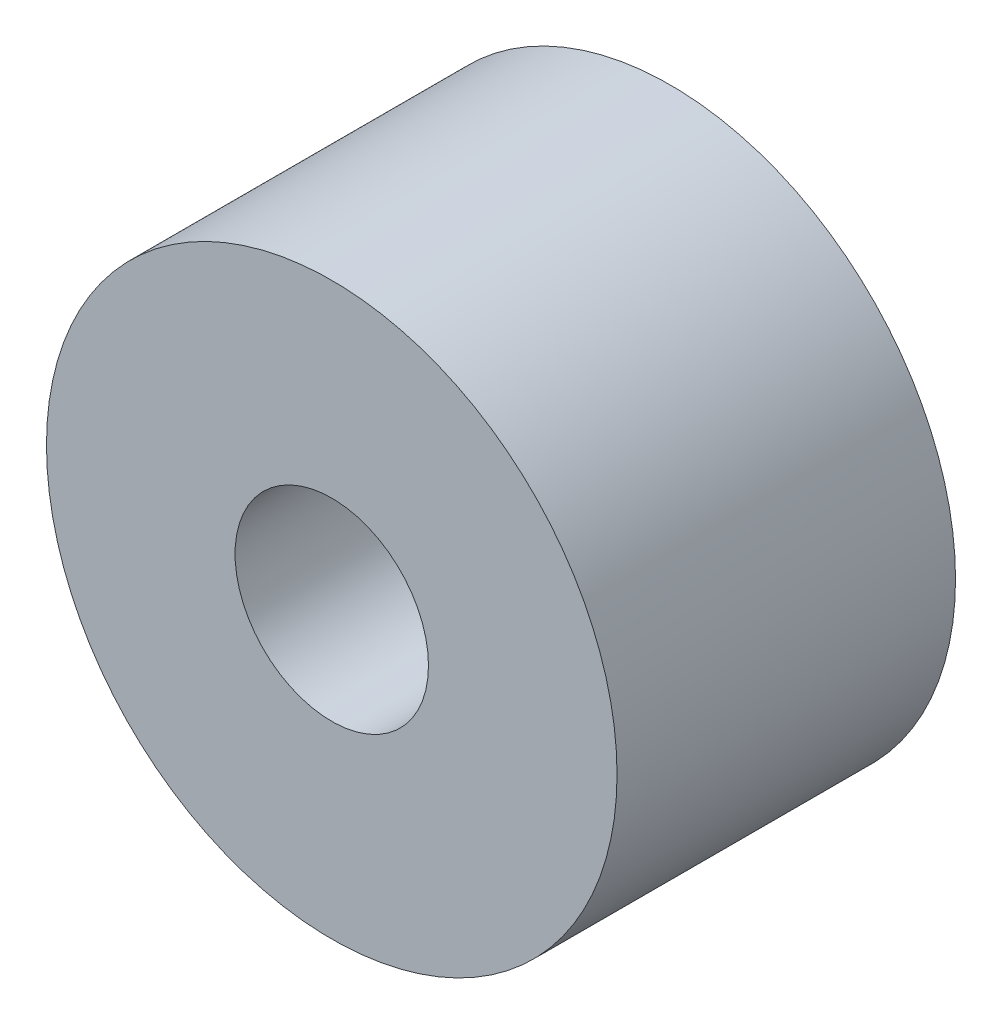
ISO-10303-21;
HEADER;
FILE_DESCRIPTION(('STEP AP214'),'2;1');
FILE_NAME('part.step','',(''),(''),'','','');
FILE_SCHEMA(('AUTOMOTIVE_DESIGN { 1 0 10303 214 1 1 1 1 }'));
ENDSEC;
DATA;
#1=APPLICATION_CONTEXT('core data for automotive mechanical design processes');
#2=APPLICATION_PROTOCOL_DEFINITION('international standard','automotive_design',2000,#1);
#3=PRODUCT_CONTEXT('',#1,'mechanical');
#4=PRODUCT('Part','Part','',(#3));
#5=PRODUCT_RELATED_PRODUCT_CATEGORY('part','',(#4));
#6=PRODUCT_DEFINITION_FORMATION('','',#4);
#7=PRODUCT_DEFINITION_CONTEXT('part definition',#1,'design');
#8=PRODUCT_DEFINITION('design','',#6,#7);
#9=PRODUCT_DEFINITION_SHAPE('','',#8);
#10=(LENGTH_UNIT() NAMED_UNIT(*) SI_UNIT(.MILLI.,.METRE.));
#11=(NAMED_UNIT(*) PLANE_ANGLE_UNIT() SI_UNIT($,.RADIAN.));
#12=(NAMED_UNIT(*) SI_UNIT($,.STERADIAN.) SOLID_ANGLE_UNIT());
#13=UNCERTAINTY_MEASURE_WITH_UNIT(LENGTH_MEASURE(1.E-05),#10,'distance_accuracy_value','');
#14=(GEOMETRIC_REPRESENTATION_CONTEXT(3) GLOBAL_UNCERTAINTY_ASSIGNED_CONTEXT((#13)) GLOBAL_UNIT_ASSIGNED_CONTEXT((#10,
#11,#12)) REPRESENTATION_CONTEXT('',''));
#15=CARTESIAN_POINT('',(0.,0.,0.));
#16=DIRECTION('',(0.,0.,1.));
#17=DIRECTION('',(1.,0.,0.));
#18=AXIS2_PLACEMENT_3D('',#15,#16,#17);
#19=CARTESIAN_POINT('',(0.,0.,7.));
#20=DIRECTION('',(0.,0.,1.));
#21=DIRECTION('',(1.,0.,0.));
#22=AXIS2_PLACEMENT_3D('',#19,#20,#21);
#23=PLANE('',#22);
#24=CARTESIAN_POINT('',(0.,0.,7.));
#25=DIRECTION('',(0.,0.,1.));
#26=DIRECTION('',(1.,0.,0.));
#27=AXIS2_PLACEMENT_3D('',#24,#25,#26);
#28=CIRCLE('',#27,5.9);
#29=CARTESIAN_POINT('',(5.9,0.,7.));
#30=VERTEX_POINT('',#29);
#31=EDGE_CURVE('E11',#30,#30,#28,.T.);
#32=ORIENTED_EDGE('',*,*,#31,.T.);
#33=EDGE_LOOP('',(#32));
#34=FACE_BOUND('',#33,.T.);
#35=CARTESIAN_POINT('',(0.,0.,7.));
#36=DIRECTION('',(0.,0.,1.));
#37=DIRECTION('',(1.,0.,0.));
#38=AXIS2_PLACEMENT_3D('',#35,#36,#37);
#39=CIRCLE('',#38,2.);
#40=CARTESIAN_POINT('',(2.,0.,7.));
#41=VERTEX_POINT('',#40);
#42=EDGE_CURVE('E49',#41,#41,#39,.T.);
#43=ORIENTED_EDGE('',*,*,#42,.F.);
#44=EDGE_LOOP('',(#43));
#45=FACE_BOUND('',#44,.T.);
#46=ADVANCED_FACE('F38',(#34,#45),#23,.T.);
#47=CARTESIAN_POINT('',(0.,0.,0.));
#48=DIRECTION('',(0.,0.,1.));
#49=DIRECTION('',(1.,0.,0.));
#50=AXIS2_PLACEMENT_3D('',#47,#48,#49);
#51=PLANE('',#50);
#52=CARTESIAN_POINT('',(0.,0.,0.));
#53=DIRECTION('',(0.,0.,1.));
#54=DIRECTION('',(1.,0.,0.));
#55=AXIS2_PLACEMENT_3D('',#52,#53,#54);
#56=CIRCLE('',#55,5.9);
#57=CARTESIAN_POINT('',(5.9,0.,0.));
#58=VERTEX_POINT('',#57);
#59=EDGE_CURVE('E42',#58,#58,#56,.T.);
#60=ORIENTED_EDGE('',*,*,#59,.F.);
#61=EDGE_LOOP('',(#60));
#62=FACE_BOUND('',#61,.T.);
#63=CARTESIAN_POINT('',(0.,0.,0.));
#64=DIRECTION('',(0.,0.,1.));
#65=DIRECTION('',(1.,0.,0.));
#66=AXIS2_PLACEMENT_3D('',#63,#64,#65);
#67=CIRCLE('',#66,2.);
#68=CARTESIAN_POINT('',(2.,0.,0.));
#69=VERTEX_POINT('',#68);
#70=EDGE_CURVE('E51',#69,#69,#67,.T.);
#71=ORIENTED_EDGE('',*,*,#70,.T.);
#72=EDGE_LOOP('',(#71));
#73=FACE_BOUND('',#72,.T.);
#74=ADVANCED_FACE('F61',(#62,#73),#51,.F.);
#75=CARTESIAN_POINT('',(0.,0.,7.));
#76=DIRECTION('',(0.,0.,-1.));
#77=DIRECTION('',(-1.,0.,0.));
#78=AXIS2_PLACEMENT_3D('',#75,#76,#77);
#79=CYLINDRICAL_SURFACE('',#78,5.9);
#80=ORIENTED_EDGE('',*,*,#31,.F.);
#81=EDGE_LOOP('',(#80));
#82=FACE_BOUND('',#81,.T.);
#83=ORIENTED_EDGE('',*,*,#59,.T.);
#84=EDGE_LOOP('',(#83));
#85=FACE_BOUND('',#84,.T.);
#86=ADVANCED_FACE('F40',(#82,#85),#79,.T.);
#87=CARTESIAN_POINT('',(0.,0.,7.));
#88=DIRECTION('',(0.,0.,-1.));
#89=DIRECTION('',(-1.,0.,0.));
#90=AXIS2_PLACEMENT_3D('',#87,#88,#89);
#91=CYLINDRICAL_SURFACE('',#90,2.);
#92=ORIENTED_EDGE('',*,*,#42,.T.);
#93=EDGE_LOOP('',(#92));
#94=FACE_BOUND('',#93,.T.);
#95=ORIENTED_EDGE('',*,*,#70,.F.);
#96=EDGE_LOOP('',(#95));
#97=FACE_BOUND('',#96,.T.);
#98=ADVANCED_FACE('F57',(#94,#97),#91,.F.);
#99=CLOSED_SHELL('',(#46,#74,#86,#98));
#100=MANIFOLD_SOLID_BREP('B2',#99);
#101=ADVANCED_BREP_SHAPE_REPRESENTATION('',(#18,#100),#14);
#102=SHAPE_DEFINITION_REPRESENTATION(#9,#101);
ENDSEC;
END-ISO-10303-21;
